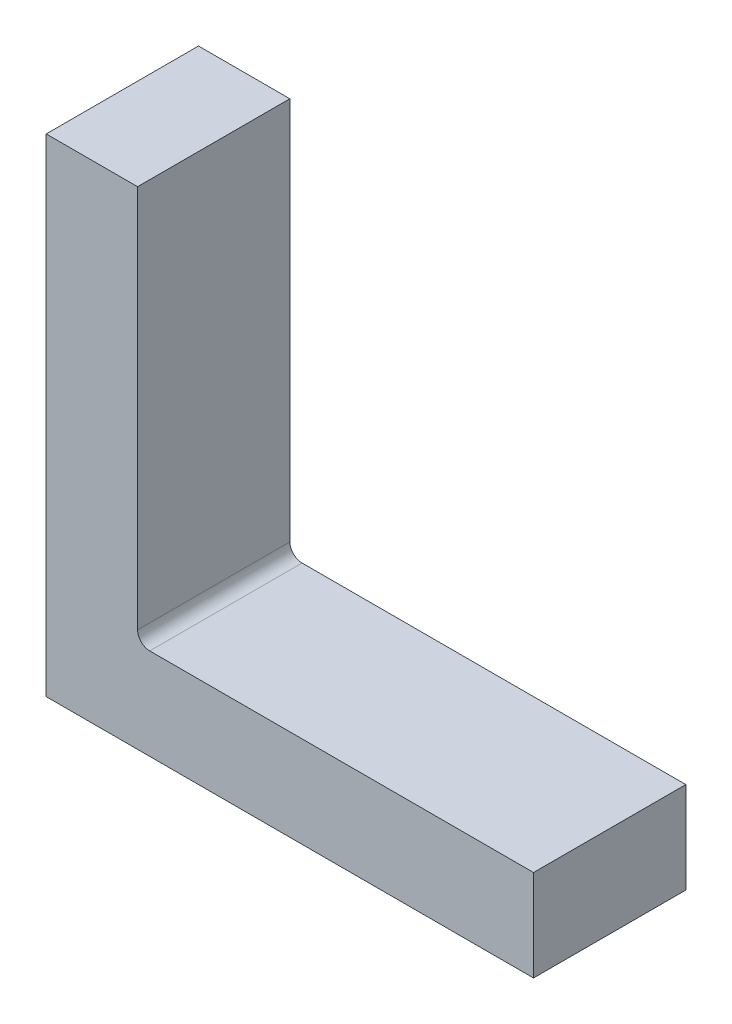
ISO-10303-21;
HEADER;
FILE_DESCRIPTION(('STEP AP214'),'2;1');
FILE_NAME('part.step','',(''),(''),'','','');
FILE_SCHEMA(('AUTOMOTIVE_DESIGN { 1 0 10303 214 1 1 1 1 }'));
ENDSEC;
DATA;
#1=APPLICATION_CONTEXT('core data for automotive mechanical design processes');
#2=APPLICATION_PROTOCOL_DEFINITION('international standard','automotive_design',2000,#1);
#3=PRODUCT_CONTEXT('',#1,'mechanical');
#4=PRODUCT('Part','Part','',(#3));
#5=PRODUCT_RELATED_PRODUCT_CATEGORY('part','',(#4));
#6=PRODUCT_DEFINITION_FORMATION('','',#4);
#7=PRODUCT_DEFINITION_CONTEXT('part definition',#1,'design');
#8=PRODUCT_DEFINITION('design','',#6,#7);
#9=PRODUCT_DEFINITION_SHAPE('','',#8);
#10=(LENGTH_UNIT() NAMED_UNIT(*) SI_UNIT(.MILLI.,.METRE.));
#11=(NAMED_UNIT(*) PLANE_ANGLE_UNIT() SI_UNIT($,.RADIAN.));
#12=(NAMED_UNIT(*) SI_UNIT($,.STERADIAN.) SOLID_ANGLE_UNIT());
#13=UNCERTAINTY_MEASURE_WITH_UNIT(LENGTH_MEASURE(1.E-05),#10,'distance_accuracy_value','');
#14=(GEOMETRIC_REPRESENTATION_CONTEXT(3) GLOBAL_UNCERTAINTY_ASSIGNED_CONTEXT((#13)) GLOBAL_UNIT_ASSIGNED_CONTEXT((#10,
#11,#12)) REPRESENTATION_CONTEXT('',''));
#15=CARTESIAN_POINT('',(0.,0.,0.));
#16=DIRECTION('',(0.,0.,1.));
#17=DIRECTION('',(1.,0.,0.));
#18=AXIS2_PLACEMENT_3D('',#15,#16,#17);
#19=CARTESIAN_POINT('',(0.,0.,31.75));
#20=DIRECTION('',(1.,0.,0.));
#21=DIRECTION('',(0.,0.,-1.));
#22=AXIS2_PLACEMENT_3D('',#19,#20,#21);
#23=PLANE('',#22);
#24=DIRECTION('',(0.,-1.,0.));
#25=VECTOR('',#24,1.);
#26=CARTESIAN_POINT('',(0.,0.,0.));
#27=LINE('',#26,#25);
#28=CARTESIAN_POINT('',(0.,101.6,0.));
#29=VERTEX_POINT('',#28);
#30=CARTESIAN_POINT('',(0.,0.,0.));
#31=VERTEX_POINT('',#30);
#32=EDGE_CURVE('E123',#29,#31,#27,.T.);
#33=ORIENTED_EDGE('',*,*,#32,.T.);
#34=DIRECTION('',(0.,0.,-1.));
#35=VECTOR('',#34,1.);
#36=CARTESIAN_POINT('',(0.,0.,31.75));
#37=LINE('',#36,#35);
#38=CARTESIAN_POINT('',(0.,0.,31.75));
#39=VERTEX_POINT('',#38);
#40=EDGE_CURVE('E104',#39,#31,#37,.T.);
#41=ORIENTED_EDGE('',*,*,#40,.F.);
#42=DIRECTION('',(0.,-1.,0.));
#43=VECTOR('',#42,1.);
#44=CARTESIAN_POINT('',(0.,0.,31.75));
#45=LINE('',#44,#43);
#46=CARTESIAN_POINT('',(0.,101.6,31.75));
#47=VERTEX_POINT('',#46);
#48=EDGE_CURVE('E111',#47,#39,#45,.T.);
#49=ORIENTED_EDGE('',*,*,#48,.F.);
#50=DIRECTION('',(0.,0.,-1.));
#51=VECTOR('',#50,1.);
#52=CARTESIAN_POINT('',(0.,101.6,31.75));
#53=LINE('',#52,#51);
#54=EDGE_CURVE('E138',#47,#29,#53,.T.);
#55=ORIENTED_EDGE('',*,*,#54,.T.);
#56=EDGE_LOOP('',(#33,#41,#49,#55));
#57=FACE_BOUND('',#56,.T.);
#58=ADVANCED_FACE('F41',(#57),#23,.F.);
#59=CARTESIAN_POINT('',(0.,0.,31.75));
#60=DIRECTION('',(0.,1.,0.));
#61=DIRECTION('',(0.,0.,1.));
#62=AXIS2_PLACEMENT_3D('',#59,#60,#61);
#63=PLANE('',#62);
#64=DIRECTION('',(1.,0.,0.));
#65=VECTOR('',#64,1.);
#66=CARTESIAN_POINT('',(0.,0.,0.));
#67=LINE('',#66,#65);
#68=CARTESIAN_POINT('',(101.6,0.,0.));
#69=VERTEX_POINT('',#68);
#70=EDGE_CURVE('E151',#31,#69,#67,.T.);
#71=ORIENTED_EDGE('',*,*,#70,.T.);
#72=DIRECTION('',(0.,0.,-1.));
#73=VECTOR('',#72,1.);
#74=CARTESIAN_POINT('',(101.6,0.,31.75));
#75=LINE('',#74,#73);
#76=CARTESIAN_POINT('',(101.6,0.,31.75));
#77=VERTEX_POINT('',#76);
#78=EDGE_CURVE('E107',#77,#69,#75,.T.);
#79=ORIENTED_EDGE('',*,*,#78,.F.);
#80=DIRECTION('',(1.,0.,0.));
#81=VECTOR('',#80,1.);
#82=CARTESIAN_POINT('',(0.,0.,31.75));
#83=LINE('',#82,#81);
#84=EDGE_CURVE('E100',#39,#77,#83,.T.);
#85=ORIENTED_EDGE('',*,*,#84,.F.);
#86=ORIENTED_EDGE('',*,*,#40,.T.);
#87=EDGE_LOOP('',(#71,#79,#85,#86));
#88=FACE_BOUND('',#87,.T.);
#89=ADVANCED_FACE('F102',(#88),#63,.F.);
#90=CARTESIAN_POINT('',(101.6,0.,31.75));
#91=DIRECTION('',(-1.,0.,0.));
#92=DIRECTION('',(0.,0.,1.));
#93=AXIS2_PLACEMENT_3D('',#90,#91,#92);
#94=PLANE('',#93);
#95=DIRECTION('',(0.,1.,0.));
#96=VECTOR('',#95,1.);
#97=CARTESIAN_POINT('',(101.6,0.,0.));
#98=LINE('',#97,#96);
#99=CARTESIAN_POINT('',(101.6,19.05,0.));
#100=VERTEX_POINT('',#99);
#101=EDGE_CURVE('E149',#69,#100,#98,.T.);
#102=ORIENTED_EDGE('',*,*,#101,.T.);
#103=DIRECTION('',(0.,0.,-1.));
#104=VECTOR('',#103,1.);
#105=CARTESIAN_POINT('',(101.6,19.05,31.75));
#106=LINE('',#105,#104);
#107=CARTESIAN_POINT('',(101.6,19.05,31.75));
#108=VERTEX_POINT('',#107);
#109=EDGE_CURVE('E128',#108,#100,#106,.T.);
#110=ORIENTED_EDGE('',*,*,#109,.F.);
#111=DIRECTION('',(0.,1.,0.));
#112=VECTOR('',#111,1.);
#113=CARTESIAN_POINT('',(101.6,0.,31.75));
#114=LINE('',#113,#112);
#115=EDGE_CURVE('E110',#77,#108,#114,.T.);
#116=ORIENTED_EDGE('',*,*,#115,.F.);
#117=ORIENTED_EDGE('',*,*,#78,.T.);
#118=EDGE_LOOP('',(#102,#110,#116,#117));
#119=FACE_BOUND('',#118,.T.);
#120=ADVANCED_FACE('F162',(#119),#94,.F.);
#121=CARTESIAN_POINT('',(19.05,19.05,31.75));
#122=DIRECTION('',(0.,-1.,0.));
#123=DIRECTION('',(0.,0.,-1.));
#124=AXIS2_PLACEMENT_3D('',#121,#122,#123);
#125=PLANE('',#124);
#126=DIRECTION('',(-1.,0.,0.));
#127=VECTOR('',#126,1.);
#128=CARTESIAN_POINT('',(19.05,19.05,0.));
#129=LINE('',#128,#127);
#130=CARTESIAN_POINT('',(21.59,19.05,0.));
#131=VERTEX_POINT('',#130);
#132=EDGE_CURVE('E147',#100,#131,#129,.T.);
#133=ORIENTED_EDGE('',*,*,#132,.T.);
#134=DIRECTION('',(0.,0.,-1.));
#135=VECTOR('',#134,1.);
#136=CARTESIAN_POINT('',(21.59,19.05,31.75));
#137=LINE('',#136,#135);
#138=CARTESIAN_POINT('',(21.59,19.05,31.75));
#139=VERTEX_POINT('',#138);
#140=EDGE_CURVE('E56',#131,#139,#137,.F.);
#141=ORIENTED_EDGE('',*,*,#140,.T.);
#142=DIRECTION('',(-1.,0.,0.));
#143=VECTOR('',#142,1.);
#144=CARTESIAN_POINT('',(19.05,19.05,31.75));
#145=LINE('',#144,#143);
#146=EDGE_CURVE('E157',#108,#139,#145,.T.);
#147=ORIENTED_EDGE('',*,*,#146,.F.);
#148=ORIENTED_EDGE('',*,*,#109,.T.);
#149=EDGE_LOOP('',(#133,#141,#147,#148));
#150=FACE_BOUND('',#149,.T.);
#151=ADVANCED_FACE('F164',(#150),#125,.F.);
#152=CARTESIAN_POINT('',(19.05,101.6,31.75));
#153=DIRECTION('',(-1.,0.,0.));
#154=DIRECTION('',(0.,-1.,0.));
#155=AXIS2_PLACEMENT_3D('',#152,#153,#154);
#156=PLANE('',#155);
#157=DIRECTION('',(0.,1.,0.));
#158=VECTOR('',#157,1.);
#159=CARTESIAN_POINT('',(19.05,101.6,31.75));
#160=LINE('',#159,#158);
#161=CARTESIAN_POINT('',(19.05,21.59,31.75));
#162=VERTEX_POINT('',#161);
#163=CARTESIAN_POINT('',(19.05,101.6,31.75));
#164=VERTEX_POINT('',#163);
#165=EDGE_CURVE('E155',#162,#164,#160,.T.);
#166=ORIENTED_EDGE('',*,*,#165,.F.);
#167=DIRECTION('',(0.,0.,-1.));
#168=VECTOR('',#167,1.);
#169=CARTESIAN_POINT('',(19.05,21.59,0.));
#170=LINE('',#169,#168);
#171=CARTESIAN_POINT('',(19.05,21.59,0.));
#172=VERTEX_POINT('',#171);
#173=EDGE_CURVE('E124',#162,#172,#170,.T.);
#174=ORIENTED_EDGE('',*,*,#173,.T.);
#175=DIRECTION('',(0.,1.,0.));
#176=VECTOR('',#175,1.);
#177=CARTESIAN_POINT('',(19.05,101.6,0.));
#178=LINE('',#177,#176);
#179=CARTESIAN_POINT('',(19.05,101.6,0.));
#180=VERTEX_POINT('',#179);
#181=EDGE_CURVE('E145',#172,#180,#178,.T.);
#182=ORIENTED_EDGE('',*,*,#181,.T.);
#183=DIRECTION('',(0.,0.,-1.));
#184=VECTOR('',#183,1.);
#185=CARTESIAN_POINT('',(19.05,101.6,31.75));
#186=LINE('',#185,#184);
#187=EDGE_CURVE('E134',#164,#180,#186,.T.);
#188=ORIENTED_EDGE('',*,*,#187,.F.);
#189=EDGE_LOOP('',(#166,#174,#182,#188));
#190=FACE_BOUND('',#189,.T.);
#191=ADVANCED_FACE('F166',(#190),#156,.F.);
#192=CARTESIAN_POINT('',(0.,101.6,31.75));
#193=DIRECTION('',(0.,-1.,0.));
#194=DIRECTION('',(0.,0.,-1.));
#195=AXIS2_PLACEMENT_3D('',#192,#193,#194);
#196=PLANE('',#195);
#197=DIRECTION('',(-1.,0.,0.));
#198=VECTOR('',#197,1.);
#199=CARTESIAN_POINT('',(0.,101.6,0.));
#200=LINE('',#199,#198);
#201=EDGE_CURVE('E120',#180,#29,#200,.T.);
#202=ORIENTED_EDGE('',*,*,#201,.T.);
#203=ORIENTED_EDGE('',*,*,#54,.F.);
#204=DIRECTION('',(-1.,0.,0.));
#205=VECTOR('',#204,1.);
#206=CARTESIAN_POINT('',(0.,101.6,31.75));
#207=LINE('',#206,#205);
#208=EDGE_CURVE('E116',#164,#47,#207,.T.);
#209=ORIENTED_EDGE('',*,*,#208,.F.);
#210=ORIENTED_EDGE('',*,*,#187,.T.);
#211=EDGE_LOOP('',(#202,#203,#209,#210));
#212=FACE_BOUND('',#211,.T.);
#213=ADVANCED_FACE('F172',(#212),#196,.F.);
#214=CARTESIAN_POINT('',(0.,101.6,31.75));
#215=DIRECTION('',(0.,0.,-1.));
#216=DIRECTION('',(-1.,0.,0.));
#217=AXIS2_PLACEMENT_3D('',#214,#215,#216);
#218=PLANE('',#217);
#219=ORIENTED_EDGE('',*,*,#48,.T.);
#220=ORIENTED_EDGE('',*,*,#84,.T.);
#221=ORIENTED_EDGE('',*,*,#115,.T.);
#222=ORIENTED_EDGE('',*,*,#146,.T.);
#223=CARTESIAN_POINT('',(21.59,21.59,31.75));
#224=DIRECTION('',(0.,0.,-1.));
#225=DIRECTION('',(-1.,0.,0.));
#226=AXIS2_PLACEMENT_3D('',#223,#224,#225);
#227=CIRCLE('',#226,2.54);
#228=EDGE_CURVE('E12',#139,#162,#227,.T.);
#229=ORIENTED_EDGE('',*,*,#228,.T.);
#230=ORIENTED_EDGE('',*,*,#165,.T.);
#231=ORIENTED_EDGE('',*,*,#208,.T.);
#232=EDGE_LOOP('',(#219,#220,#221,#222,#229,#230,#231));
#233=FACE_BOUND('',#232,.T.);
#234=ADVANCED_FACE('F114',(#233),#218,.F.);
#235=CARTESIAN_POINT('',(0.,101.6,0.));
#236=DIRECTION('',(0.,0.,-1.));
#237=DIRECTION('',(-1.,0.,0.));
#238=AXIS2_PLACEMENT_3D('',#235,#236,#237);
#239=PLANE('',#238);
#240=ORIENTED_EDGE('',*,*,#32,.F.);
#241=ORIENTED_EDGE('',*,*,#201,.F.);
#242=ORIENTED_EDGE('',*,*,#181,.F.);
#243=CARTESIAN_POINT('',(21.59,21.59,0.));
#244=DIRECTION('',(0.,0.,-1.));
#245=DIRECTION('',(-1.,0.,0.));
#246=AXIS2_PLACEMENT_3D('',#243,#244,#245);
#247=CIRCLE('',#246,2.54);
#248=EDGE_CURVE('E49',#172,#131,#247,.F.);
#249=ORIENTED_EDGE('',*,*,#248,.T.);
#250=ORIENTED_EDGE('',*,*,#132,.F.);
#251=ORIENTED_EDGE('',*,*,#101,.F.);
#252=ORIENTED_EDGE('',*,*,#70,.F.);
#253=EDGE_LOOP('',(#240,#241,#242,#249,#250,#251,#252));
#254=FACE_BOUND('',#253,.T.);
#255=ADVANCED_FACE('F215',(#254),#239,.T.);
#256=CARTESIAN_POINT('',(21.59,21.59,31.75));
#257=DIRECTION('',(0.,0.,1.));
#258=DIRECTION('',(1.,0.,0.));
#259=AXIS2_PLACEMENT_3D('',#256,#257,#258);
#260=CYLINDRICAL_SURFACE('',#259,2.54);
#261=ORIENTED_EDGE('',*,*,#228,.F.);
#262=ORIENTED_EDGE('',*,*,#140,.F.);
#263=ORIENTED_EDGE('',*,*,#248,.F.);
#264=ORIENTED_EDGE('',*,*,#173,.F.);
#265=EDGE_LOOP('',(#261,#262,#263,#264));
#266=FACE_BOUND('',#265,.T.);
#267=ADVANCED_FACE('F43',(#266),#260,.F.);
#268=CLOSED_SHELL('',(#58,#89,#120,#151,#191,#213,#234,#255,#267));
#269=MANIFOLD_SOLID_BREP('B2',#268);
#270=ADVANCED_BREP_SHAPE_REPRESENTATION('',(#18,#269),#14);
#271=SHAPE_DEFINITION_REPRESENTATION(#9,#270);
ENDSEC;
END-ISO-10303-21;
